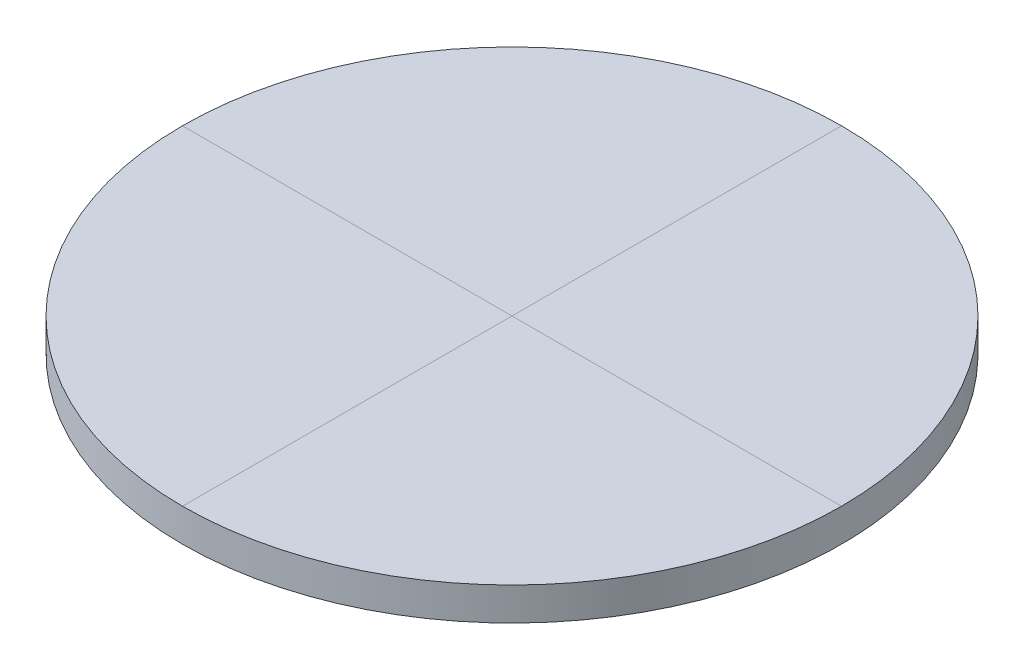
ISO-10303-21;
HEADER;
FILE_DESCRIPTION(('STEP AP214'),'2;1');
FILE_NAME('part.step','',(''),(''),'','','');
FILE_SCHEMA(('AUTOMOTIVE_DESIGN { 1 0 10303 214 1 1 1 1 }'));
ENDSEC;
DATA;
#1=APPLICATION_CONTEXT('core data for automotive mechanical design processes');
#2=APPLICATION_PROTOCOL_DEFINITION('international standard','automotive_design',2000,#1);
#3=PRODUCT_CONTEXT('',#1,'mechanical');
#4=PRODUCT('Part','Part','',(#3));
#5=PRODUCT_RELATED_PRODUCT_CATEGORY('part','',(#4));
#6=PRODUCT_DEFINITION_FORMATION('','',#4);
#7=PRODUCT_DEFINITION_CONTEXT('part definition',#1,'design');
#8=PRODUCT_DEFINITION('design','',#6,#7);
#9=PRODUCT_DEFINITION_SHAPE('','',#8);
#10=(LENGTH_UNIT() NAMED_UNIT(*) SI_UNIT(.MILLI.,.METRE.));
#11=(NAMED_UNIT(*) PLANE_ANGLE_UNIT() SI_UNIT($,.RADIAN.));
#12=(NAMED_UNIT(*) SI_UNIT($,.STERADIAN.) SOLID_ANGLE_UNIT());
#13=UNCERTAINTY_MEASURE_WITH_UNIT(LENGTH_MEASURE(1.E-05),#10,'distance_accuracy_value','');
#14=(GEOMETRIC_REPRESENTATION_CONTEXT(3) GLOBAL_UNCERTAINTY_ASSIGNED_CONTEXT((#13)) GLOBAL_UNIT_ASSIGNED_CONTEXT((#10,
#11,#12)) REPRESENTATION_CONTEXT('',''));
#15=CARTESIAN_POINT('',(0.,0.,0.));
#16=DIRECTION('',(0.,0.,1.));
#17=DIRECTION('',(1.,0.,0.));
#18=AXIS2_PLACEMENT_3D('',#15,#16,#17);
#19=CARTESIAN_POINT('',(0.,3.,0.));
#20=DIRECTION('',(0.,1.,0.));
#21=DIRECTION('',(0.,0.,1.));
#22=AXIS2_PLACEMENT_3D('',#19,#20,#21);
#23=PLANE('',#22);
#24=CARTESIAN_POINT('',(0.,3.,0.));
#25=DIRECTION('',(0.,1.,0.));
#26=DIRECTION('',(0.,0.,1.));
#27=AXIS2_PLACEMENT_3D('',#24,#25,#26);
#28=CIRCLE('',#27,30.);
#29=CARTESIAN_POINT('',(-30.,3.,0.));
#30=VERTEX_POINT('',#29);
#31=CARTESIAN_POINT('',(0.,3.,30.));
#32=VERTEX_POINT('',#31);
#33=EDGE_CURVE('E69',#30,#32,#28,.T.);
#34=ORIENTED_EDGE('',*,*,#33,.T.);
#35=DIRECTION('',(0.,0.,-1.));
#36=VECTOR('',#35,1.);
#37=CARTESIAN_POINT('',(0.,3.,0.));
#38=LINE('',#37,#36);
#39=CARTESIAN_POINT('',(0.,3.,0.));
#40=VERTEX_POINT('',#39);
#41=EDGE_CURVE('E12',#32,#40,#38,.T.);
#42=ORIENTED_EDGE('',*,*,#41,.T.);
#43=DIRECTION('',(1.,0.,0.));
#44=VECTOR('',#43,1.);
#45=CARTESIAN_POINT('',(0.,3.,0.));
#46=LINE('',#45,#44);
#47=EDGE_CURVE('E77',#30,#40,#46,.T.);
#48=ORIENTED_EDGE('',*,*,#47,.F.);
#49=EDGE_LOOP('',(#34,#42,#48));
#50=FACE_BOUND('',#49,.T.);
#51=ADVANCED_FACE('F34',(#50),#23,.T.);
#52=ORIENTED_EDGE('',*,*,#47,.T.);
#53=DIRECTION('',(0.,0.,-1.));
#54=VECTOR('',#53,1.);
#55=CARTESIAN_POINT('',(0.,3.,0.));
#56=LINE('',#55,#54);
#57=CARTESIAN_POINT('',(0.,3.,-30.));
#58=VERTEX_POINT('',#57);
#59=EDGE_CURVE('E42',#40,#58,#56,.T.);
#60=ORIENTED_EDGE('',*,*,#59,.T.);
#61=EDGE_CURVE('E72',#58,#30,#28,.T.);
#62=ORIENTED_EDGE('',*,*,#61,.T.);
#63=EDGE_LOOP('',(#52,#60,#62));
#64=FACE_BOUND('',#63,.T.);
#65=ADVANCED_FACE('F93',(#64),#23,.T.);
#66=ORIENTED_EDGE('',*,*,#59,.F.);
#67=CARTESIAN_POINT('',(30.,3.,0.));
#68=VERTEX_POINT('',#67);
#69=EDGE_CURVE('E64',#40,#68,#46,.T.);
#70=ORIENTED_EDGE('',*,*,#69,.T.);
#71=EDGE_CURVE('E73',#68,#58,#28,.T.);
#72=ORIENTED_EDGE('',*,*,#71,.T.);
#73=EDGE_LOOP('',(#66,#70,#72));
#74=FACE_BOUND('',#73,.T.);
#75=ADVANCED_FACE('F76',(#74),#23,.T.);
#76=CARTESIAN_POINT('',(0.,3.,0.));
#77=DIRECTION('',(0.,-1.,0.));
#78=DIRECTION('',(0.,0.,-1.));
#79=AXIS2_PLACEMENT_3D('',#76,#77,#78);
#80=CYLINDRICAL_SURFACE('',#79,30.);
#81=ORIENTED_EDGE('',*,*,#71,.F.);
#82=EDGE_CURVE('E61',#32,#68,#28,.T.);
#83=ORIENTED_EDGE('',*,*,#82,.F.);
#84=ORIENTED_EDGE('',*,*,#33,.F.);
#85=ORIENTED_EDGE('',*,*,#61,.F.);
#86=EDGE_LOOP('',(#81,#83,#84,#85));
#87=FACE_BOUND('',#86,.T.);
#88=CARTESIAN_POINT('',(0.,0.,0.));
#89=DIRECTION('',(0.,1.,0.));
#90=DIRECTION('',(0.,0.,1.));
#91=AXIS2_PLACEMENT_3D('',#88,#89,#90);
#92=CIRCLE('',#91,30.);
#93=CARTESIAN_POINT('',(0.,0.,30.));
#94=VERTEX_POINT('',#93);
#95=EDGE_CURVE('E70',#94,#94,#92,.T.);
#96=ORIENTED_EDGE('',*,*,#95,.T.);
#97=EDGE_LOOP('',(#96));
#98=FACE_BOUND('',#97,.T.);
#99=ADVANCED_FACE('F36',(#87,#98),#80,.T.);
#100=ORIENTED_EDGE('',*,*,#41,.F.);
#101=ORIENTED_EDGE('',*,*,#82,.T.);
#102=ORIENTED_EDGE('',*,*,#69,.F.);
#103=EDGE_LOOP('',(#100,#101,#102));
#104=FACE_BOUND('',#103,.T.);
#105=ADVANCED_FACE('F63',(#104),#23,.T.);
#106=CARTESIAN_POINT('',(0.,0.,0.));
#107=DIRECTION('',(0.,1.,0.));
#108=DIRECTION('',(0.,0.,1.));
#109=AXIS2_PLACEMENT_3D('',#106,#107,#108);
#110=PLANE('',#109);
#111=ORIENTED_EDGE('',*,*,#95,.F.);
#112=EDGE_LOOP('',(#111));
#113=FACE_BOUND('',#112,.T.);
#114=ADVANCED_FACE('F86',(#113),#110,.F.);
#115=CLOSED_SHELL('',(#51,#65,#75,#99,#105,#114));
#116=MANIFOLD_SOLID_BREP('B2',#115);
#117=ADVANCED_BREP_SHAPE_REPRESENTATION('',(#18,#116),#14);
#118=SHAPE_DEFINITION_REPRESENTATION(#9,#117);
ENDSEC;
END-ISO-10303-21;
